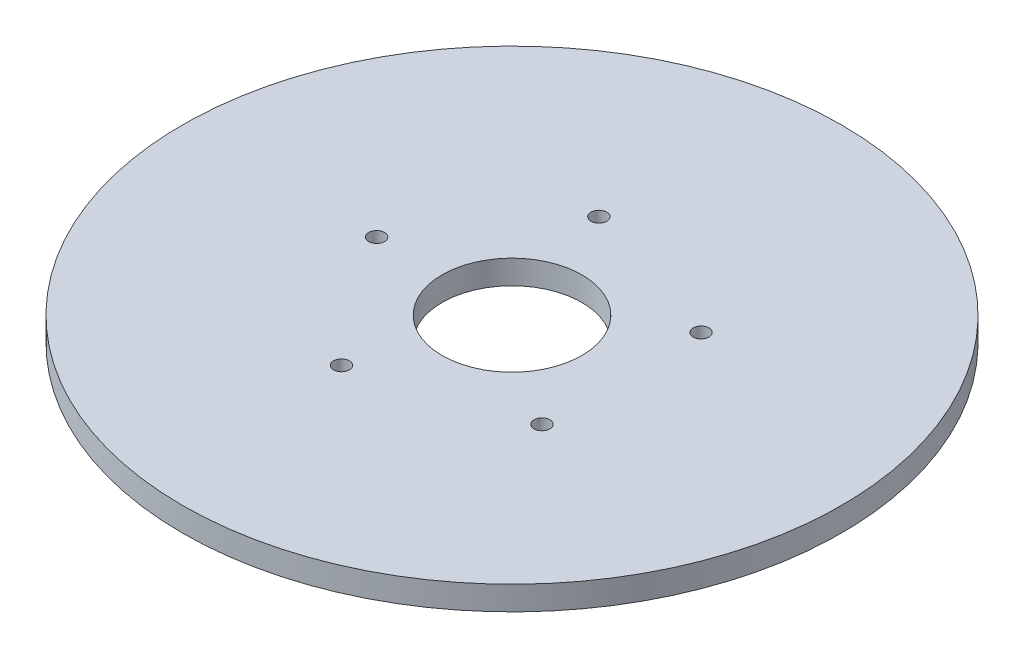
ISO-10303-21;
HEADER;
FILE_DESCRIPTION(('STEP AP214'),'2;1');
FILE_NAME('part.step','',(''),(''),'','','');
FILE_SCHEMA(('AUTOMOTIVE_DESIGN { 1 0 10303 214 1 1 1 1 }'));
ENDSEC;
DATA;
#1=APPLICATION_CONTEXT('core data for automotive mechanical design processes');
#2=APPLICATION_PROTOCOL_DEFINITION('international standard','automotive_design',2000,#1);
#3=PRODUCT_CONTEXT('',#1,'mechanical');
#4=PRODUCT('Part','Part','',(#3));
#5=PRODUCT_RELATED_PRODUCT_CATEGORY('part','',(#4));
#6=PRODUCT_DEFINITION_FORMATION('','',#4);
#7=PRODUCT_DEFINITION_CONTEXT('part definition',#1,'design');
#8=PRODUCT_DEFINITION('design','',#6,#7);
#9=PRODUCT_DEFINITION_SHAPE('','',#8);
#10=(LENGTH_UNIT() NAMED_UNIT(*) SI_UNIT(.MILLI.,.METRE.));
#11=(NAMED_UNIT(*) PLANE_ANGLE_UNIT() SI_UNIT($,.RADIAN.));
#12=(NAMED_UNIT(*) SI_UNIT($,.STERADIAN.) SOLID_ANGLE_UNIT());
#13=UNCERTAINTY_MEASURE_WITH_UNIT(LENGTH_MEASURE(1.E-05),#10,'distance_accuracy_value','');
#14=(GEOMETRIC_REPRESENTATION_CONTEXT(3) GLOBAL_UNCERTAINTY_ASSIGNED_CONTEXT((#13)) GLOBAL_UNIT_ASSIGNED_CONTEXT((#10,
#11,#12)) REPRESENTATION_CONTEXT('',''));
#15=CARTESIAN_POINT('',(0.,0.,0.));
#16=DIRECTION('',(0.,0.,1.));
#17=DIRECTION('',(1.,0.,0.));
#18=AXIS2_PLACEMENT_3D('',#15,#16,#17);
#19=CARTESIAN_POINT('',(0.,6.,0.));
#20=DIRECTION('',(0.,-1.,0.));
#21=DIRECTION('',(0.,0.,-1.));
#22=AXIS2_PLACEMENT_3D('',#19,#20,#21);
#23=CYLINDRICAL_SURFACE('',#22,82.5);
#24=CARTESIAN_POINT('',(0.,6.,0.));
#25=DIRECTION('',(0.,1.,0.));
#26=DIRECTION('',(0.,0.,1.));
#27=AXIS2_PLACEMENT_3D('',#24,#25,#26);
#28=CIRCLE('',#27,82.5);
#29=CARTESIAN_POINT('',(0.,6.,82.5));
#30=VERTEX_POINT('',#29);
#31=EDGE_CURVE('E10',#30,#30,#28,.T.);
#32=ORIENTED_EDGE('',*,*,#31,.F.);
#33=EDGE_LOOP('',(#32));
#34=FACE_BOUND('',#33,.T.);
#35=CARTESIAN_POINT('',(0.,0.,0.));
#36=DIRECTION('',(0.,1.,0.));
#37=DIRECTION('',(0.,0.,1.));
#38=AXIS2_PLACEMENT_3D('',#35,#36,#37);
#39=CIRCLE('',#38,82.5);
#40=CARTESIAN_POINT('',(0.,0.,82.5));
#41=VERTEX_POINT('',#40);
#42=EDGE_CURVE('E37',#41,#41,#39,.T.);
#43=ORIENTED_EDGE('',*,*,#42,.T.);
#44=EDGE_LOOP('',(#43));
#45=FACE_BOUND('',#44,.T.);
#46=ADVANCED_FACE('F40',(#34,#45),#23,.T.);
#47=CARTESIAN_POINT('',(0.,6.,0.));
#48=DIRECTION('',(0.,1.,0.));
#49=DIRECTION('',(0.,0.,1.));
#50=AXIS2_PLACEMENT_3D('',#47,#48,#49);
#51=PLANE('',#50);
#52=CARTESIAN_POINT('',(-10.4708659952054,6.,32.2260118934121));
#53=DIRECTION('',(0.,1.,0.));
#54=DIRECTION('',(0.951056516295155,0.,0.309016994374945));
#55=AXIS2_PLACEMENT_3D('',#52,#53,#54);
#56=CIRCLE('',#55,1.98026602607169);
#57=CARTESIAN_POINT('',(-10.4708659952054,6.,34.2062779194838));
#58=VERTEX_POINT('',#57);
#59=EDGE_CURVE('E78',#58,#58,#56,.T.);
#60=ORIENTED_EDGE('',*,*,#59,.F.);
#61=EDGE_LOOP('',(#60));
#62=FACE_BOUND('',#61,.T.);
#63=CARTESIAN_POINT('',(27.4130830670936,6.,19.9167706719869));
#64=DIRECTION('',(0.,1.,0.));
#65=DIRECTION('',(0.587785252292469,0.,-0.809016994374951));
#66=AXIS2_PLACEMENT_3D('',#63,#64,#65);
#67=CIRCLE('',#66,1.98026602607169);
#68=CARTESIAN_POINT('',(27.4130830670936,6.,21.8970366980586));
#69=VERTEX_POINT('',#68);
#70=EDGE_CURVE('E71',#69,#69,#67,.T.);
#71=ORIENTED_EDGE('',*,*,#70,.F.);
#72=EDGE_LOOP('',(#71));
#73=FACE_BOUND('',#72,.T.);
#74=CARTESIAN_POINT('',(27.4130830670933,6.,-19.9167706719873));
#75=DIRECTION('',(0.,1.,0.));
#76=DIRECTION('',(-0.58778525229248,0.,-0.809016994374942));
#77=AXIS2_PLACEMENT_3D('',#74,#75,#76);
#78=CIRCLE('',#77,1.98026602607169);
#79=CARTESIAN_POINT('',(27.4130830670933,6.,-17.9365046459156));
#80=VERTEX_POINT('',#79);
#81=EDGE_CURVE('E70',#80,#80,#78,.T.);
#82=ORIENTED_EDGE('',*,*,#81,.F.);
#83=EDGE_LOOP('',(#82));
#84=FACE_BOUND('',#83,.T.);
#85=CARTESIAN_POINT('',(-10.4708659952059,6.,-32.226011893412));
#86=DIRECTION('',(0.,1.,0.));
#87=DIRECTION('',(-0.95105651629515,0.,0.309016994374958));
#88=AXIS2_PLACEMENT_3D('',#85,#86,#87);
#89=CIRCLE('',#88,1.98026602607169);
#90=CARTESIAN_POINT('',(-10.4708659952059,6.,-30.2457458673403));
#91=VERTEX_POINT('',#90);
#92=EDGE_CURVE('E61',#91,#91,#89,.T.);
#93=ORIENTED_EDGE('',*,*,#92,.F.);
#94=EDGE_LOOP('',(#93));
#95=FACE_BOUND('',#94,.T.);
#96=CARTESIAN_POINT('',(-33.8844341437759,6.,0.));
#97=DIRECTION('',(0.,1.,0.));
#98=DIRECTION('',(0.,0.,1.));
#99=AXIS2_PLACEMENT_3D('',#96,#97,#98);
#100=CIRCLE('',#99,1.98026602607169);
#101=CARTESIAN_POINT('',(-33.8844341437759,6.,1.98026602607169));
#102=VERTEX_POINT('',#101);
#103=EDGE_CURVE('E54',#102,#102,#100,.T.);
#104=ORIENTED_EDGE('',*,*,#103,.F.);
#105=EDGE_LOOP('',(#104));
#106=FACE_BOUND('',#105,.T.);
#107=CARTESIAN_POINT('',(0.,6.,0.));
#108=DIRECTION('',(0.,1.,0.));
#109=DIRECTION('',(0.,0.,1.));
#110=AXIS2_PLACEMENT_3D('',#107,#108,#109);
#111=CIRCLE('',#110,17.5);
#112=CARTESIAN_POINT('',(0.,6.,17.5));
#113=VERTEX_POINT('',#112);
#114=EDGE_CURVE('E50',#113,#113,#111,.T.);
#115=ORIENTED_EDGE('',*,*,#114,.F.);
#116=EDGE_LOOP('',(#115));
#117=FACE_BOUND('',#116,.T.);
#118=ORIENTED_EDGE('',*,*,#31,.T.);
#119=EDGE_LOOP('',(#118));
#120=FACE_BOUND('',#119,.T.);
#121=ADVANCED_FACE('F94',(#62,#73,#84,#95,#106,#117,#120),#51,.T.);
#122=CARTESIAN_POINT('',(0.,0.,0.));
#123=DIRECTION('',(0.,1.,0.));
#124=DIRECTION('',(0.,0.,1.));
#125=AXIS2_PLACEMENT_3D('',#122,#123,#124);
#126=PLANE('',#125);
#127=CARTESIAN_POINT('',(0.,0.,0.));
#128=DIRECTION('',(0.,1.,0.));
#129=DIRECTION('',(0.,0.,1.));
#130=AXIS2_PLACEMENT_3D('',#127,#128,#129);
#131=CIRCLE('',#130,17.5);
#132=CARTESIAN_POINT('',(0.,0.,17.5));
#133=VERTEX_POINT('',#132);
#134=EDGE_CURVE('E47',#133,#133,#131,.T.);
#135=ORIENTED_EDGE('',*,*,#134,.T.);
#136=EDGE_LOOP('',(#135));
#137=FACE_BOUND('',#136,.T.);
#138=ORIENTED_EDGE('',*,*,#42,.F.);
#139=EDGE_LOOP('',(#138));
#140=FACE_BOUND('',#139,.T.);
#141=ADVANCED_FACE('F100',(#137,#140),#126,.F.);
#142=CARTESIAN_POINT('',(0.,6.,0.));
#143=DIRECTION('',(0.,-1.,0.));
#144=DIRECTION('',(0.,0.,-1.));
#145=AXIS2_PLACEMENT_3D('',#142,#143,#144);
#146=CYLINDRICAL_SURFACE('',#145,17.5);
#147=ORIENTED_EDGE('',*,*,#114,.T.);
#148=EDGE_LOOP('',(#147));
#149=FACE_BOUND('',#148,.T.);
#150=ORIENTED_EDGE('',*,*,#134,.F.);
#151=EDGE_LOOP('',(#150));
#152=FACE_BOUND('',#151,.T.);
#153=ADVANCED_FACE('F108',(#149,#152),#146,.F.);
#154=CARTESIAN_POINT('',(-33.8844341437759,2.18777489392981,0.));
#155=DIRECTION('',(0.,1.,0.));
#156=DIRECTION('',(0.,0.,1.));
#157=AXIS2_PLACEMENT_3D('',#154,#155,#156);
#158=CYLINDRICAL_SURFACE('',#157,1.98026602607169);
#159=CARTESIAN_POINT('',(-33.8844341437759,2.18777489392981,0.));
#160=DIRECTION('',(0.,1.,0.));
#161=DIRECTION('',(0.,0.,1.));
#162=AXIS2_PLACEMENT_3D('',#159,#160,#161);
#163=CIRCLE('',#162,1.98026602607169);
#164=CARTESIAN_POINT('',(-33.8844341437759,2.18777489392981,1.98026602607169));
#165=VERTEX_POINT('',#164);
#166=EDGE_CURVE('E55',#165,#165,#163,.T.);
#167=CARTESIAN_POINT('',(-33.8844341437759,2.18777489392981,1.98026602607169));
#168=CARTESIAN_POINT('',(-33.8844341437759,2.22748557211804,1.98026602607169));
#169=CARTESIAN_POINT('',(-33.8844341437759,2.26719625030627,1.98026602607169));
#170=CARTESIAN_POINT('',(-33.8844341437759,2.34661760668273,1.98026602607169));
#171=CARTESIAN_POINT('',(-33.8844341437759,2.38632828487096,1.98026602607169));
#172=CARTESIAN_POINT('',(-33.8844341437759,2.46574964124743,1.98026602607169));
#173=CARTESIAN_POINT('',(-33.8844341437759,2.50546031943566,1.98026602607169));
#174=CARTESIAN_POINT('',(-33.8844341437759,2.58488167581212,1.98026602607169));
#175=CARTESIAN_POINT('',(-33.8844341437759,2.62459235400035,1.98026602607169));
#176=CARTESIAN_POINT('',(-33.8844341437759,2.70401371037681,1.98026602607169));
#177=CARTESIAN_POINT('',(-33.8844341437759,2.74372438856504,1.98026602607169));
#178=CARTESIAN_POINT('',(-33.8844341437759,2.82314574494151,1.98026602607169));
#179=CARTESIAN_POINT('',(-33.8844341437759,2.86285642312974,1.98026602607169));
#180=CARTESIAN_POINT('',(-33.8844341437759,2.9422777795062,1.98026602607169));
#181=CARTESIAN_POINT('',(-33.8844341437759,2.98198845769443,1.98026602607169));
#182=CARTESIAN_POINT('',(-33.8844341437759,3.06140981407089,1.98026602607169));
#183=CARTESIAN_POINT('',(-33.8844341437759,3.10112049225912,1.98026602607169));
#184=CARTESIAN_POINT('',(-33.8844341437759,3.18054184863559,1.98026602607169));
#185=CARTESIAN_POINT('',(-33.8844341437759,3.22025252682382,1.98026602607169));
#186=CARTESIAN_POINT('',(-33.8844341437759,3.29967388320028,1.98026602607169));
#187=CARTESIAN_POINT('',(-33.8844341437759,3.33938456138851,1.98026602607169));
#188=CARTESIAN_POINT('',(-33.8844341437759,3.41880591776497,1.98026602607169));
#189=CARTESIAN_POINT('',(-33.8844341437759,3.4585165959532,1.98026602607169));
#190=CARTESIAN_POINT('',(-33.8844341437759,3.53793795232967,1.98026602607169));
#191=CARTESIAN_POINT('',(-33.8844341437759,3.5776486305179,1.98026602607169));
#192=CARTESIAN_POINT('',(-33.8844341437759,3.65706998689436,1.98026602607169));
#193=CARTESIAN_POINT('',(-33.8844341437759,3.69678066508259,1.98026602607169));
#194=CARTESIAN_POINT('',(-33.8844341437759,3.77620202145905,1.98026602607169));
#195=CARTESIAN_POINT('',(-33.8844341437759,3.81591269964729,1.98026602607169));
#196=CARTESIAN_POINT('',(-33.8844341437759,3.89533405602375,1.98026602607169));
#197=CARTESIAN_POINT('',(-33.8844341437759,3.93504473421198,1.98026602607169));
#198=CARTESIAN_POINT('',(-33.8844341437759,4.01446609058844,1.98026602607169));
#199=CARTESIAN_POINT('',(-33.8844341437759,4.05417676877667,1.98026602607169));
#200=CARTESIAN_POINT('',(-33.8844341437759,4.13359812515313,1.98026602607169));
#201=CARTESIAN_POINT('',(-33.8844341437759,4.17330880334137,1.98026602607169));
#202=CARTESIAN_POINT('',(-33.8844341437759,4.25273015971783,1.98026602607169));
#203=CARTESIAN_POINT('',(-33.8844341437759,4.29244083790606,1.98026602607169));
#204=CARTESIAN_POINT('',(-33.8844341437759,4.37186219428252,1.98026602607169));
#205=CARTESIAN_POINT('',(-33.8844341437759,4.41157287247075,1.98026602607169));
#206=CARTESIAN_POINT('',(-33.8844341437759,4.49099422884721,1.98026602607169));
#207=CARTESIAN_POINT('',(-33.8844341437759,4.53070490703545,1.98026602607169));
#208=CARTESIAN_POINT('',(-33.8844341437759,4.61012626341191,1.98026602607169));
#209=CARTESIAN_POINT('',(-33.8844341437759,4.64983694160014,1.98026602607169));
#210=CARTESIAN_POINT('',(-33.8844341437759,4.7292582979766,1.98026602607169));
#211=CARTESIAN_POINT('',(-33.8844341437759,4.76896897616483,1.98026602607169));
#212=CARTESIAN_POINT('',(-33.8844341437759,4.8483903325413,1.98026602607169));
#213=CARTESIAN_POINT('',(-33.8844341437759,4.88810101072953,1.98026602607169));
#214=CARTESIAN_POINT('',(-33.8844341437759,4.96752236710599,1.98026602607169));
#215=CARTESIAN_POINT('',(-33.8844341437759,5.00723304529422,1.98026602607169));
#216=CARTESIAN_POINT('',(-33.8844341437759,5.08665440167068,1.98026602607169));
#217=CARTESIAN_POINT('',(-33.8844341437759,5.12636507985891,1.98026602607169));
#218=CARTESIAN_POINT('',(-33.8844341437759,5.20578643623538,1.98026602607169));
#219=CARTESIAN_POINT('',(-33.8844341437759,5.24549711442361,1.98026602607169));
#220=CARTESIAN_POINT('',(-33.8844341437759,5.32491847080007,1.98026602607169));
#221=CARTESIAN_POINT('',(-33.8844341437759,5.3646291489883,1.98026602607169));
#222=CARTESIAN_POINT('',(-33.8844341437759,5.44405050536476,1.98026602607169));
#223=CARTESIAN_POINT('',(-33.8844341437759,5.48376118355299,1.98026602607169));
#224=CARTESIAN_POINT('',(-33.8844341437759,5.56318253992946,1.98026602607169));
#225=CARTESIAN_POINT('',(-33.8844341437759,5.60289321811769,1.98026602607169));
#226=CARTESIAN_POINT('',(-33.8844341437759,5.68231457449415,1.98026602607169));
#227=CARTESIAN_POINT('',(-33.8844341437759,5.72202525268238,1.98026602607169));
#228=CARTESIAN_POINT('',(-33.8844341437759,5.80144660905884,1.98026602607169));
#229=CARTESIAN_POINT('',(-33.8844341437759,5.84115728724707,1.98026602607169));
#230=CARTESIAN_POINT('',(-33.8844341437759,5.92057864362354,1.98026602607169));
#231=CARTESIAN_POINT('',(-33.8844341437759,5.96028932181177,1.98026602607169));
#232=CARTESIAN_POINT('',(-33.8844341437759,6.,1.98026602607169));
#233=B_SPLINE_CURVE_WITH_KNOTS('',3,(#167,#168,#169,#170,#171,#172,#173,#174,#175,#176,#177,
#178,#179,#180,#181,#182,#183,#184,#185,#186,#187,#188,#189,#190,#191,#192,#193,#194,#195,#196,
#197,#198,#199,#200,#201,#202,#203,#204,#205,#206,#207,#208,#209,#210,#211,#212,#213,#214,#215,
#216,#217,#218,#219,#220,#221,#222,#223,#224,#225,#226,#227,#228,#229,#230,#231,#232),
.UNSPECIFIED.,.F.,.F.,(4,2,2,2,2,2,2,2,2,2,2,2,2,2,2,2,2,2,2,2,2,2,2,2,2,2,2,2,2,2,2,2,4),(0.,
0.119132034564694,0.238264069129387,0.35739610369408,0.476528138258774,0.595660172823468,
0.714792207388161,0.833924241952855,0.953056276517548,1.07218831108224,1.19132034564694,
1.31045238021163,1.42958441477632,1.54871644934102,1.66784848390571,1.7869805184704,
1.9061125530351,2.02524458759979,2.14437662216448,2.26350865672918,2.38264069129387,
2.50177272585856,2.62090476042326,2.74003679498795,2.85916882955264,2.97830086411734,
3.09743289868203,3.21656493324672,3.33569696781142,3.45482900237611,3.57396103694081,
3.6930930715055,3.81222510607019),.UNSPECIFIED.);
#234=EDGE_CURVE('BSEAM115',#165,#102,#233,.T.);
#235=ORIENTED_EDGE('',*,*,#166,.F.);
#236=ORIENTED_EDGE('',*,*,#103,.T.);
#237=ORIENTED_EDGE('',*,*,#234,.T.);
#238=ORIENTED_EDGE('',*,*,#234,.F.);
#239=EDGE_LOOP('',(#235,#237,#236,#238));
#240=FACE_BOUND('',#239,.T.);
#241=ADVANCED_FACE('F115',(#240),#158,.F.);
#242=CARTESIAN_POINT('',(-33.8844341437759,2.18777489392981,0.));
#243=DIRECTION('',(0.,1.,0.));
#244=DIRECTION('',(0.,0.,1.));
#245=AXIS2_PLACEMENT_3D('',#242,#243,#244);
#246=PLANE('',#245);
#247=ORIENTED_EDGE('',*,*,#166,.T.);
#248=EDGE_LOOP('',(#247));
#249=FACE_BOUND('',#248,.T.);
#250=ADVANCED_FACE('F142',(#249),#246,.T.);
#251=CARTESIAN_POINT('',(-10.4708659952059,2.18777489392981,-32.226011893412));
#252=DIRECTION('',(0.,1.,0.));
#253=DIRECTION('',(0.,0.,1.));
#254=AXIS2_PLACEMENT_3D('',#251,#252,#253);
#255=CYLINDRICAL_SURFACE('',#254,1.98026602607169);
#256=CARTESIAN_POINT('',(-10.4708659952059,2.18777489392981,-32.226011893412));
#257=DIRECTION('',(0.,1.,0.));
#258=DIRECTION('',(-0.95105651629515,0.,0.309016994374958));
#259=AXIS2_PLACEMENT_3D('',#256,#257,#258);
#260=CIRCLE('',#259,1.98026602607169);
#261=CARTESIAN_POINT('',(-10.4708659952059,2.18777489392981,-30.2457458673403));
#262=VERTEX_POINT('',#261);
#263=EDGE_CURVE('E63',#262,#262,#260,.T.);
#264=CARTESIAN_POINT('',(-10.4708659952059,2.18777489392981,-30.2457458673403));
#265=CARTESIAN_POINT('',(-10.4708659952059,2.22748557211804,-30.2457458673403));
#266=CARTESIAN_POINT('',(-10.4708659952059,2.26719625030627,-30.2457458673403));
#267=CARTESIAN_POINT('',(-10.4708659952059,2.34661760668273,-30.2457458673403));
#268=CARTESIAN_POINT('',(-10.4708659952059,2.38632828487096,-30.2457458673403));
#269=CARTESIAN_POINT('',(-10.4708659952059,2.46574964124743,-30.2457458673403));
#270=CARTESIAN_POINT('',(-10.4708659952059,2.50546031943566,-30.2457458673403));
#271=CARTESIAN_POINT('',(-10.4708659952059,2.58488167581212,-30.2457458673403));
#272=CARTESIAN_POINT('',(-10.4708659952059,2.62459235400035,-30.2457458673403));
#273=CARTESIAN_POINT('',(-10.4708659952059,2.70401371037681,-30.2457458673403));
#274=CARTESIAN_POINT('',(-10.4708659952059,2.74372438856504,-30.2457458673403));
#275=CARTESIAN_POINT('',(-10.4708659952059,2.82314574494151,-30.2457458673403));
#276=CARTESIAN_POINT('',(-10.4708659952059,2.86285642312974,-30.2457458673403));
#277=CARTESIAN_POINT('',(-10.4708659952059,2.9422777795062,-30.2457458673403));
#278=CARTESIAN_POINT('',(-10.4708659952059,2.98198845769443,-30.2457458673403));
#279=CARTESIAN_POINT('',(-10.4708659952059,3.06140981407089,-30.2457458673403));
#280=CARTESIAN_POINT('',(-10.4708659952059,3.10112049225912,-30.2457458673403));
#281=CARTESIAN_POINT('',(-10.4708659952059,3.18054184863559,-30.2457458673403));
#282=CARTESIAN_POINT('',(-10.4708659952059,3.22025252682382,-30.2457458673403));
#283=CARTESIAN_POINT('',(-10.4708659952059,3.29967388320028,-30.2457458673403));
#284=CARTESIAN_POINT('',(-10.4708659952059,3.33938456138851,-30.2457458673403));
#285=CARTESIAN_POINT('',(-10.4708659952059,3.41880591776497,-30.2457458673403));
#286=CARTESIAN_POINT('',(-10.4708659952059,3.4585165959532,-30.2457458673403));
#287=CARTESIAN_POINT('',(-10.4708659952059,3.53793795232967,-30.2457458673403));
#288=CARTESIAN_POINT('',(-10.4708659952059,3.5776486305179,-30.2457458673403));
#289=CARTESIAN_POINT('',(-10.4708659952059,3.65706998689436,-30.2457458673403));
#290=CARTESIAN_POINT('',(-10.4708659952059,3.69678066508259,-30.2457458673403));
#291=CARTESIAN_POINT('',(-10.4708659952059,3.77620202145905,-30.2457458673403));
#292=CARTESIAN_POINT('',(-10.4708659952059,3.81591269964729,-30.2457458673403));
#293=CARTESIAN_POINT('',(-10.4708659952059,3.89533405602375,-30.2457458673403));
#294=CARTESIAN_POINT('',(-10.4708659952059,3.93504473421198,-30.2457458673403));
#295=CARTESIAN_POINT('',(-10.4708659952059,4.01446609058844,-30.2457458673403));
#296=CARTESIAN_POINT('',(-10.4708659952059,4.05417676877667,-30.2457458673403));
#297=CARTESIAN_POINT('',(-10.4708659952059,4.13359812515313,-30.2457458673403));
#298=CARTESIAN_POINT('',(-10.4708659952059,4.17330880334137,-30.2457458673403));
#299=CARTESIAN_POINT('',(-10.4708659952059,4.25273015971783,-30.2457458673403));
#300=CARTESIAN_POINT('',(-10.4708659952059,4.29244083790606,-30.2457458673403));
#301=CARTESIAN_POINT('',(-10.4708659952059,4.37186219428252,-30.2457458673403));
#302=CARTESIAN_POINT('',(-10.4708659952059,4.41157287247075,-30.2457458673403));
#303=CARTESIAN_POINT('',(-10.4708659952059,4.49099422884721,-30.2457458673403));
#304=CARTESIAN_POINT('',(-10.4708659952059,4.53070490703545,-30.2457458673403));
#305=CARTESIAN_POINT('',(-10.4708659952059,4.61012626341191,-30.2457458673403));
#306=CARTESIAN_POINT('',(-10.4708659952059,4.64983694160014,-30.2457458673403));
#307=CARTESIAN_POINT('',(-10.4708659952059,4.7292582979766,-30.2457458673403));
#308=CARTESIAN_POINT('',(-10.4708659952059,4.76896897616483,-30.2457458673403));
#309=CARTESIAN_POINT('',(-10.4708659952059,4.8483903325413,-30.2457458673403));
#310=CARTESIAN_POINT('',(-10.4708659952059,4.88810101072953,-30.2457458673403));
#311=CARTESIAN_POINT('',(-10.4708659952059,4.96752236710599,-30.2457458673403));
#312=CARTESIAN_POINT('',(-10.4708659952059,5.00723304529422,-30.2457458673403));
#313=CARTESIAN_POINT('',(-10.4708659952059,5.08665440167068,-30.2457458673403));
#314=CARTESIAN_POINT('',(-10.4708659952059,5.12636507985891,-30.2457458673403));
#315=CARTESIAN_POINT('',(-10.4708659952059,5.20578643623538,-30.2457458673403));
#316=CARTESIAN_POINT('',(-10.4708659952059,5.24549711442361,-30.2457458673403));
#317=CARTESIAN_POINT('',(-10.4708659952059,5.32491847080007,-30.2457458673403));
#318=CARTESIAN_POINT('',(-10.4708659952059,5.3646291489883,-30.2457458673403));
#319=CARTESIAN_POINT('',(-10.4708659952059,5.44405050536476,-30.2457458673403));
#320=CARTESIAN_POINT('',(-10.4708659952059,5.48376118355299,-30.2457458673403));
#321=CARTESIAN_POINT('',(-10.4708659952059,5.56318253992946,-30.2457458673403));
#322=CARTESIAN_POINT('',(-10.4708659952059,5.60289321811769,-30.2457458673403));
#323=CARTESIAN_POINT('',(-10.4708659952059,5.68231457449415,-30.2457458673403));
#324=CARTESIAN_POINT('',(-10.4708659952059,5.72202525268238,-30.2457458673403));
#325=CARTESIAN_POINT('',(-10.4708659952059,5.80144660905884,-30.2457458673403));
#326=CARTESIAN_POINT('',(-10.4708659952059,5.84115728724707,-30.2457458673403));
#327=CARTESIAN_POINT('',(-10.4708659952059,5.92057864362354,-30.2457458673403));
#328=CARTESIAN_POINT('',(-10.4708659952059,5.96028932181177,-30.2457458673403));
#329=CARTESIAN_POINT('',(-10.4708659952059,6.,-30.2457458673403));
#330=B_SPLINE_CURVE_WITH_KNOTS('',3,(#264,#265,#266,#267,#268,#269,#270,#271,#272,#273,#274,
#275,#276,#277,#278,#279,#280,#281,#282,#283,#284,#285,#286,#287,#288,#289,#290,#291,#292,#293,
#294,#295,#296,#297,#298,#299,#300,#301,#302,#303,#304,#305,#306,#307,#308,#309,#310,#311,#312,
#313,#314,#315,#316,#317,#318,#319,#320,#321,#322,#323,#324,#325,#326,#327,#328,#329),
.UNSPECIFIED.,.F.,.F.,(4,2,2,2,2,2,2,2,2,2,2,2,2,2,2,2,2,2,2,2,2,2,2,2,2,2,2,2,2,2,2,2,4),(0.,
0.119132034564694,0.238264069129387,0.35739610369408,0.476528138258774,0.595660172823468,
0.714792207388161,0.833924241952855,0.953056276517548,1.07218831108224,1.19132034564694,
1.31045238021163,1.42958441477632,1.54871644934102,1.66784848390571,1.7869805184704,
1.9061125530351,2.02524458759979,2.14437662216448,2.26350865672918,2.38264069129387,
2.50177272585856,2.62090476042326,2.74003679498795,2.85916882955264,2.97830086411734,
3.09743289868203,3.21656493324672,3.33569696781142,3.45482900237611,3.57396103694081,
3.6930930715055,3.81222510607019),.UNSPECIFIED.);
#331=EDGE_CURVE('BSEAM147',#262,#91,#330,.T.);
#332=ORIENTED_EDGE('',*,*,#263,.F.);
#333=ORIENTED_EDGE('',*,*,#92,.T.);
#334=ORIENTED_EDGE('',*,*,#331,.T.);
#335=ORIENTED_EDGE('',*,*,#331,.F.);
#336=EDGE_LOOP('',(#332,#334,#333,#335));
#337=FACE_BOUND('',#336,.T.);
#338=ADVANCED_FACE('F147',(#337),#255,.F.);
#339=CARTESIAN_POINT('',(-10.4708659952059,2.18777489392981,-32.226011893412));
#340=DIRECTION('',(0.,1.,0.));
#341=DIRECTION('',(-0.95105651629515,0.,0.309016994374958));
#342=AXIS2_PLACEMENT_3D('',#339,#340,#341);
#343=PLANE('',#342);
#344=ORIENTED_EDGE('',*,*,#263,.T.);
#345=EDGE_LOOP('',(#344));
#346=FACE_BOUND('',#345,.T.);
#347=ADVANCED_FACE('F163',(#346),#343,.T.);
#348=CARTESIAN_POINT('',(27.4130830670933,2.18777489392981,-19.9167706719873));
#349=DIRECTION('',(0.,1.,0.));
#350=DIRECTION('',(0.,0.,1.));
#351=AXIS2_PLACEMENT_3D('',#348,#349,#350);
#352=CYLINDRICAL_SURFACE('',#351,1.98026602607169);
#353=CARTESIAN_POINT('',(27.4130830670933,2.18777489392981,-19.9167706719873));
#354=DIRECTION('',(0.,1.,0.));
#355=DIRECTION('',(-0.58778525229248,0.,-0.809016994374942));
#356=AXIS2_PLACEMENT_3D('',#353,#354,#355);
#357=CIRCLE('',#356,1.98026602607169);
#358=CARTESIAN_POINT('',(27.4130830670933,2.18777489392981,-17.9365046459156));
#359=VERTEX_POINT('',#358);
#360=EDGE_CURVE('E69',#359,#359,#357,.T.);
#361=CARTESIAN_POINT('',(27.4130830670933,2.18777489392981,-17.9365046459156));
#362=CARTESIAN_POINT('',(27.4130830670933,2.22748557211804,-17.9365046459156));
#363=CARTESIAN_POINT('',(27.4130830670933,2.26719625030627,-17.9365046459156));
#364=CARTESIAN_POINT('',(27.4130830670933,2.34661760668273,-17.9365046459156));
#365=CARTESIAN_POINT('',(27.4130830670933,2.38632828487096,-17.9365046459156));
#366=CARTESIAN_POINT('',(27.4130830670933,2.46574964124743,-17.9365046459156));
#367=CARTESIAN_POINT('',(27.4130830670933,2.50546031943566,-17.9365046459156));
#368=CARTESIAN_POINT('',(27.4130830670933,2.58488167581212,-17.9365046459156));
#369=CARTESIAN_POINT('',(27.4130830670933,2.62459235400035,-17.9365046459156));
#370=CARTESIAN_POINT('',(27.4130830670933,2.70401371037681,-17.9365046459156));
#371=CARTESIAN_POINT('',(27.4130830670933,2.74372438856504,-17.9365046459156));
#372=CARTESIAN_POINT('',(27.4130830670933,2.82314574494151,-17.9365046459156));
#373=CARTESIAN_POINT('',(27.4130830670933,2.86285642312974,-17.9365046459156));
#374=CARTESIAN_POINT('',(27.4130830670933,2.9422777795062,-17.9365046459156));
#375=CARTESIAN_POINT('',(27.4130830670933,2.98198845769443,-17.9365046459156));
#376=CARTESIAN_POINT('',(27.4130830670933,3.06140981407089,-17.9365046459156));
#377=CARTESIAN_POINT('',(27.4130830670933,3.10112049225912,-17.9365046459156));
#378=CARTESIAN_POINT('',(27.4130830670933,3.18054184863559,-17.9365046459156));
#379=CARTESIAN_POINT('',(27.4130830670933,3.22025252682382,-17.9365046459156));
#380=CARTESIAN_POINT('',(27.4130830670933,3.29967388320028,-17.9365046459156));
#381=CARTESIAN_POINT('',(27.4130830670933,3.33938456138851,-17.9365046459156));
#382=CARTESIAN_POINT('',(27.4130830670933,3.41880591776497,-17.9365046459156));
#383=CARTESIAN_POINT('',(27.4130830670933,3.4585165959532,-17.9365046459156));
#384=CARTESIAN_POINT('',(27.4130830670933,3.53793795232967,-17.9365046459156));
#385=CARTESIAN_POINT('',(27.4130830670933,3.5776486305179,-17.9365046459156));
#386=CARTESIAN_POINT('',(27.4130830670933,3.65706998689436,-17.9365046459156));
#387=CARTESIAN_POINT('',(27.4130830670933,3.69678066508259,-17.9365046459156));
#388=CARTESIAN_POINT('',(27.4130830670933,3.77620202145905,-17.9365046459156));
#389=CARTESIAN_POINT('',(27.4130830670933,3.81591269964729,-17.9365046459156));
#390=CARTESIAN_POINT('',(27.4130830670933,3.89533405602375,-17.9365046459156));
#391=CARTESIAN_POINT('',(27.4130830670933,3.93504473421198,-17.9365046459156));
#392=CARTESIAN_POINT('',(27.4130830670933,4.01446609058844,-17.9365046459156));
#393=CARTESIAN_POINT('',(27.4130830670933,4.05417676877667,-17.9365046459156));
#394=CARTESIAN_POINT('',(27.4130830670933,4.13359812515313,-17.9365046459156));
#395=CARTESIAN_POINT('',(27.4130830670933,4.17330880334137,-17.9365046459156));
#396=CARTESIAN_POINT('',(27.4130830670933,4.25273015971783,-17.9365046459156));
#397=CARTESIAN_POINT('',(27.4130830670933,4.29244083790606,-17.9365046459156));
#398=CARTESIAN_POINT('',(27.4130830670933,4.37186219428252,-17.9365046459156));
#399=CARTESIAN_POINT('',(27.4130830670933,4.41157287247075,-17.9365046459156));
#400=CARTESIAN_POINT('',(27.4130830670933,4.49099422884721,-17.9365046459156));
#401=CARTESIAN_POINT('',(27.4130830670933,4.53070490703545,-17.9365046459156));
#402=CARTESIAN_POINT('',(27.4130830670933,4.61012626341191,-17.9365046459156));
#403=CARTESIAN_POINT('',(27.4130830670933,4.64983694160014,-17.9365046459156));
#404=CARTESIAN_POINT('',(27.4130830670933,4.7292582979766,-17.9365046459156));
#405=CARTESIAN_POINT('',(27.4130830670933,4.76896897616483,-17.9365046459156));
#406=CARTESIAN_POINT('',(27.4130830670933,4.8483903325413,-17.9365046459156));
#407=CARTESIAN_POINT('',(27.4130830670933,4.88810101072953,-17.9365046459156));
#408=CARTESIAN_POINT('',(27.4130830670933,4.96752236710599,-17.9365046459156));
#409=CARTESIAN_POINT('',(27.4130830670933,5.00723304529422,-17.9365046459156));
#410=CARTESIAN_POINT('',(27.4130830670933,5.08665440167068,-17.9365046459156));
#411=CARTESIAN_POINT('',(27.4130830670933,5.12636507985891,-17.9365046459156));
#412=CARTESIAN_POINT('',(27.4130830670933,5.20578643623538,-17.9365046459156));
#413=CARTESIAN_POINT('',(27.4130830670933,5.24549711442361,-17.9365046459156));
#414=CARTESIAN_POINT('',(27.4130830670933,5.32491847080007,-17.9365046459156));
#415=CARTESIAN_POINT('',(27.4130830670933,5.3646291489883,-17.9365046459156));
#416=CARTESIAN_POINT('',(27.4130830670933,5.44405050536476,-17.9365046459156));
#417=CARTESIAN_POINT('',(27.4130830670933,5.48376118355299,-17.9365046459156));
#418=CARTESIAN_POINT('',(27.4130830670933,5.56318253992946,-17.9365046459156));
#419=CARTESIAN_POINT('',(27.4130830670933,5.60289321811769,-17.9365046459156));
#420=CARTESIAN_POINT('',(27.4130830670933,5.68231457449415,-17.9365046459156));
#421=CARTESIAN_POINT('',(27.4130830670933,5.72202525268238,-17.9365046459156));
#422=CARTESIAN_POINT('',(27.4130830670933,5.80144660905884,-17.9365046459156));
#423=CARTESIAN_POINT('',(27.4130830670933,5.84115728724707,-17.9365046459156));
#424=CARTESIAN_POINT('',(27.4130830670933,5.92057864362354,-17.9365046459156));
#425=CARTESIAN_POINT('',(27.4130830670933,5.96028932181177,-17.9365046459156));
#426=CARTESIAN_POINT('',(27.4130830670933,6.,-17.9365046459156));
#427=B_SPLINE_CURVE_WITH_KNOTS('',3,(#361,#362,#363,#364,#365,#366,#367,#368,#369,#370,#371,
#372,#373,#374,#375,#376,#377,#378,#379,#380,#381,#382,#383,#384,#385,#386,#387,#388,#389,#390,
#391,#392,#393,#394,#395,#396,#397,#398,#399,#400,#401,#402,#403,#404,#405,#406,#407,#408,#409,
#410,#411,#412,#413,#414,#415,#416,#417,#418,#419,#420,#421,#422,#423,#424,#425,#426),
.UNSPECIFIED.,.F.,.F.,(4,2,2,2,2,2,2,2,2,2,2,2,2,2,2,2,2,2,2,2,2,2,2,2,2,2,2,2,2,2,2,2,4),(0.,
0.119132034564694,0.238264069129387,0.35739610369408,0.476528138258774,0.595660172823468,
0.714792207388161,0.833924241952855,0.953056276517548,1.07218831108224,1.19132034564694,
1.31045238021163,1.42958441477632,1.54871644934102,1.66784848390571,1.7869805184704,
1.9061125530351,2.02524458759979,2.14437662216448,2.26350865672918,2.38264069129387,
2.50177272585856,2.62090476042326,2.74003679498795,2.85916882955264,2.97830086411734,
3.09743289868203,3.21656493324672,3.33569696781142,3.45482900237611,3.57396103694081,
3.6930930715055,3.81222510607019),.UNSPECIFIED.);
#428=EDGE_CURVE('BSEAM172',#359,#80,#427,.T.);
#429=ORIENTED_EDGE('',*,*,#360,.F.);
#430=ORIENTED_EDGE('',*,*,#81,.T.);
#431=ORIENTED_EDGE('',*,*,#428,.T.);
#432=ORIENTED_EDGE('',*,*,#428,.F.);
#433=EDGE_LOOP('',(#429,#431,#430,#432));
#434=FACE_BOUND('',#433,.T.);
#435=ADVANCED_FACE('F172',(#434),#352,.F.);
#436=CARTESIAN_POINT('',(27.4130830670933,2.18777489392981,-19.9167706719873));
#437=DIRECTION('',(0.,1.,0.));
#438=DIRECTION('',(-0.58778525229248,0.,-0.809016994374942));
#439=AXIS2_PLACEMENT_3D('',#436,#437,#438);
#440=PLANE('',#439);
#441=ORIENTED_EDGE('',*,*,#360,.T.);
#442=EDGE_LOOP('',(#441));
#443=FACE_BOUND('',#442,.T.);
#444=ADVANCED_FACE('F185',(#443),#440,.T.);
#445=CARTESIAN_POINT('',(27.4130830670936,2.18777489392981,19.9167706719869));
#446=DIRECTION('',(0.,1.,0.));
#447=DIRECTION('',(0.,0.,1.));
#448=AXIS2_PLACEMENT_3D('',#445,#446,#447);
#449=CYLINDRICAL_SURFACE('',#448,1.98026602607169);
#450=CARTESIAN_POINT('',(27.4130830670936,2.18777489392981,19.9167706719869));
#451=DIRECTION('',(0.,1.,0.));
#452=DIRECTION('',(0.587785252292469,0.,-0.809016994374951));
#453=AXIS2_PLACEMENT_3D('',#450,#451,#452);
#454=CIRCLE('',#453,1.98026602607169);
#455=CARTESIAN_POINT('',(27.4130830670936,2.18777489392981,21.8970366980586));
#456=VERTEX_POINT('',#455);
#457=EDGE_CURVE('E76',#456,#456,#454,.T.);
#458=CARTESIAN_POINT('',(27.4130830670936,2.18777489392981,21.8970366980586));
#459=CARTESIAN_POINT('',(27.4130830670936,2.22748557211804,21.8970366980586));
#460=CARTESIAN_POINT('',(27.4130830670936,2.26719625030627,21.8970366980586));
#461=CARTESIAN_POINT('',(27.4130830670936,2.34661760668273,21.8970366980586));
#462=CARTESIAN_POINT('',(27.4130830670936,2.38632828487096,21.8970366980586));
#463=CARTESIAN_POINT('',(27.4130830670936,2.46574964124743,21.8970366980586));
#464=CARTESIAN_POINT('',(27.4130830670936,2.50546031943566,21.8970366980586));
#465=CARTESIAN_POINT('',(27.4130830670936,2.58488167581212,21.8970366980586));
#466=CARTESIAN_POINT('',(27.4130830670936,2.62459235400035,21.8970366980586));
#467=CARTESIAN_POINT('',(27.4130830670936,2.70401371037681,21.8970366980586));
#468=CARTESIAN_POINT('',(27.4130830670936,2.74372438856504,21.8970366980586));
#469=CARTESIAN_POINT('',(27.4130830670936,2.82314574494151,21.8970366980586));
#470=CARTESIAN_POINT('',(27.4130830670936,2.86285642312974,21.8970366980586));
#471=CARTESIAN_POINT('',(27.4130830670936,2.9422777795062,21.8970366980586));
#472=CARTESIAN_POINT('',(27.4130830670936,2.98198845769443,21.8970366980586));
#473=CARTESIAN_POINT('',(27.4130830670936,3.06140981407089,21.8970366980586));
#474=CARTESIAN_POINT('',(27.4130830670936,3.10112049225912,21.8970366980586));
#475=CARTESIAN_POINT('',(27.4130830670936,3.18054184863559,21.8970366980586));
#476=CARTESIAN_POINT('',(27.4130830670936,3.22025252682382,21.8970366980586));
#477=CARTESIAN_POINT('',(27.4130830670936,3.29967388320028,21.8970366980586));
#478=CARTESIAN_POINT('',(27.4130830670936,3.33938456138851,21.8970366980586));
#479=CARTESIAN_POINT('',(27.4130830670936,3.41880591776497,21.8970366980586));
#480=CARTESIAN_POINT('',(27.4130830670936,3.4585165959532,21.8970366980586));
#481=CARTESIAN_POINT('',(27.4130830670936,3.53793795232967,21.8970366980586));
#482=CARTESIAN_POINT('',(27.4130830670936,3.5776486305179,21.8970366980586));
#483=CARTESIAN_POINT('',(27.4130830670936,3.65706998689436,21.8970366980586));
#484=CARTESIAN_POINT('',(27.4130830670936,3.69678066508259,21.8970366980586));
#485=CARTESIAN_POINT('',(27.4130830670936,3.77620202145905,21.8970366980586));
#486=CARTESIAN_POINT('',(27.4130830670936,3.81591269964729,21.8970366980586));
#487=CARTESIAN_POINT('',(27.4130830670936,3.89533405602375,21.8970366980586));
#488=CARTESIAN_POINT('',(27.4130830670936,3.93504473421198,21.8970366980586));
#489=CARTESIAN_POINT('',(27.4130830670936,4.01446609058844,21.8970366980586));
#490=CARTESIAN_POINT('',(27.4130830670936,4.05417676877667,21.8970366980586));
#491=CARTESIAN_POINT('',(27.4130830670936,4.13359812515313,21.8970366980586));
#492=CARTESIAN_POINT('',(27.4130830670936,4.17330880334137,21.8970366980586));
#493=CARTESIAN_POINT('',(27.4130830670936,4.25273015971783,21.8970366980586));
#494=CARTESIAN_POINT('',(27.4130830670936,4.29244083790606,21.8970366980586));
#495=CARTESIAN_POINT('',(27.4130830670936,4.37186219428252,21.8970366980586));
#496=CARTESIAN_POINT('',(27.4130830670936,4.41157287247075,21.8970366980586));
#497=CARTESIAN_POINT('',(27.4130830670936,4.49099422884721,21.8970366980586));
#498=CARTESIAN_POINT('',(27.4130830670936,4.53070490703545,21.8970366980586));
#499=CARTESIAN_POINT('',(27.4130830670936,4.61012626341191,21.8970366980586));
#500=CARTESIAN_POINT('',(27.4130830670936,4.64983694160014,21.8970366980586));
#501=CARTESIAN_POINT('',(27.4130830670936,4.7292582979766,21.8970366980586));
#502=CARTESIAN_POINT('',(27.4130830670936,4.76896897616483,21.8970366980586));
#503=CARTESIAN_POINT('',(27.4130830670936,4.8483903325413,21.8970366980586));
#504=CARTESIAN_POINT('',(27.4130830670936,4.88810101072953,21.8970366980586));
#505=CARTESIAN_POINT('',(27.4130830670936,4.96752236710599,21.8970366980586));
#506=CARTESIAN_POINT('',(27.4130830670936,5.00723304529422,21.8970366980586));
#507=CARTESIAN_POINT('',(27.4130830670936,5.08665440167068,21.8970366980586));
#508=CARTESIAN_POINT('',(27.4130830670936,5.12636507985891,21.8970366980586));
#509=CARTESIAN_POINT('',(27.4130830670936,5.20578643623538,21.8970366980586));
#510=CARTESIAN_POINT('',(27.4130830670936,5.24549711442361,21.8970366980586));
#511=CARTESIAN_POINT('',(27.4130830670936,5.32491847080007,21.8970366980586));
#512=CARTESIAN_POINT('',(27.4130830670936,5.3646291489883,21.8970366980586));
#513=CARTESIAN_POINT('',(27.4130830670936,5.44405050536476,21.8970366980586));
#514=CARTESIAN_POINT('',(27.4130830670936,5.48376118355299,21.8970366980586));
#515=CARTESIAN_POINT('',(27.4130830670936,5.56318253992946,21.8970366980586));
#516=CARTESIAN_POINT('',(27.4130830670936,5.60289321811769,21.8970366980586));
#517=CARTESIAN_POINT('',(27.4130830670936,5.68231457449415,21.8970366980586));
#518=CARTESIAN_POINT('',(27.4130830670936,5.72202525268238,21.8970366980586));
#519=CARTESIAN_POINT('',(27.4130830670936,5.80144660905884,21.8970366980586));
#520=CARTESIAN_POINT('',(27.4130830670936,5.84115728724707,21.8970366980586));
#521=CARTESIAN_POINT('',(27.4130830670936,5.92057864362354,21.8970366980586));
#522=CARTESIAN_POINT('',(27.4130830670936,5.96028932181177,21.8970366980586));
#523=CARTESIAN_POINT('',(27.4130830670936,6.,21.8970366980586));
#524=B_SPLINE_CURVE_WITH_KNOTS('',3,(#458,#459,#460,#461,#462,#463,#464,#465,#466,#467,#468,
#469,#470,#471,#472,#473,#474,#475,#476,#477,#478,#479,#480,#481,#482,#483,#484,#485,#486,#487,
#488,#489,#490,#491,#492,#493,#494,#495,#496,#497,#498,#499,#500,#501,#502,#503,#504,#505,#506,
#507,#508,#509,#510,#511,#512,#513,#514,#515,#516,#517,#518,#519,#520,#521,#522,#523),
.UNSPECIFIED.,.F.,.F.,(4,2,2,2,2,2,2,2,2,2,2,2,2,2,2,2,2,2,2,2,2,2,2,2,2,2,2,2,2,2,2,2,4),(0.,
0.119132034564694,0.238264069129387,0.35739610369408,0.476528138258774,0.595660172823468,
0.714792207388161,0.833924241952855,0.953056276517548,1.07218831108224,1.19132034564694,
1.31045238021163,1.42958441477632,1.54871644934102,1.66784848390571,1.7869805184704,
1.9061125530351,2.02524458759979,2.14437662216448,2.26350865672918,2.38264069129387,
2.50177272585856,2.62090476042326,2.74003679498795,2.85916882955264,2.97830086411734,
3.09743289868203,3.21656493324672,3.33569696781142,3.45482900237611,3.57396103694081,
3.6930930715055,3.81222510607019),.UNSPECIFIED.);
#525=EDGE_CURVE('BSEAM191',#456,#69,#524,.T.);
#526=ORIENTED_EDGE('',*,*,#457,.F.);
#527=ORIENTED_EDGE('',*,*,#70,.T.);
#528=ORIENTED_EDGE('',*,*,#525,.T.);
#529=ORIENTED_EDGE('',*,*,#525,.F.);
#530=EDGE_LOOP('',(#526,#528,#527,#529));
#531=FACE_BOUND('',#530,.T.);
#532=ADVANCED_FACE('F191',(#531),#449,.F.);
#533=CARTESIAN_POINT('',(27.4130830670936,2.18777489392981,19.9167706719869));
#534=DIRECTION('',(0.,1.,0.));
#535=DIRECTION('',(0.587785252292469,0.,-0.809016994374951));
#536=AXIS2_PLACEMENT_3D('',#533,#534,#535);
#537=PLANE('',#536);
#538=ORIENTED_EDGE('',*,*,#457,.T.);
#539=EDGE_LOOP('',(#538));
#540=FACE_BOUND('',#539,.T.);
#541=ADVANCED_FACE('F89',(#540),#537,.T.);
#542=CARTESIAN_POINT('',(-10.4708659952054,2.18777489392981,32.2260118934121));
#543=DIRECTION('',(0.,1.,0.));
#544=DIRECTION('',(0.,0.,1.));
#545=AXIS2_PLACEMENT_3D('',#542,#543,#544);
#546=CYLINDRICAL_SURFACE('',#545,1.98026602607169);
#547=CARTESIAN_POINT('',(-10.4708659952054,2.18777489392981,32.2260118934121));
#548=DIRECTION('',(0.,1.,0.));
#549=DIRECTION('',(0.951056516295155,0.,0.309016994374945));
#550=AXIS2_PLACEMENT_3D('',#547,#548,#549);
#551=CIRCLE('',#550,1.98026602607169);
#552=CARTESIAN_POINT('',(-10.4708659952054,2.18777489392981,34.2062779194838));
#553=VERTEX_POINT('',#552);
#554=EDGE_CURVE('E59',#553,#553,#551,.T.);
#555=CARTESIAN_POINT('',(-10.4708659952054,2.18777489392981,34.2062779194838));
#556=CARTESIAN_POINT('',(-10.4708659952054,2.22748557211804,34.2062779194838));
#557=CARTESIAN_POINT('',(-10.4708659952054,2.26719625030627,34.2062779194838));
#558=CARTESIAN_POINT('',(-10.4708659952054,2.34661760668273,34.2062779194838));
#559=CARTESIAN_POINT('',(-10.4708659952054,2.38632828487096,34.2062779194838));
#560=CARTESIAN_POINT('',(-10.4708659952054,2.46574964124743,34.2062779194838));
#561=CARTESIAN_POINT('',(-10.4708659952054,2.50546031943566,34.2062779194838));
#562=CARTESIAN_POINT('',(-10.4708659952054,2.58488167581212,34.2062779194838));
#563=CARTESIAN_POINT('',(-10.4708659952054,2.62459235400035,34.2062779194838));
#564=CARTESIAN_POINT('',(-10.4708659952054,2.70401371037681,34.2062779194838));
#565=CARTESIAN_POINT('',(-10.4708659952054,2.74372438856504,34.2062779194838));
#566=CARTESIAN_POINT('',(-10.4708659952054,2.82314574494151,34.2062779194838));
#567=CARTESIAN_POINT('',(-10.4708659952054,2.86285642312974,34.2062779194838));
#568=CARTESIAN_POINT('',(-10.4708659952054,2.9422777795062,34.2062779194838));
#569=CARTESIAN_POINT('',(-10.4708659952054,2.98198845769443,34.2062779194838));
#570=CARTESIAN_POINT('',(-10.4708659952054,3.06140981407089,34.2062779194838));
#571=CARTESIAN_POINT('',(-10.4708659952054,3.10112049225912,34.2062779194838));
#572=CARTESIAN_POINT('',(-10.4708659952054,3.18054184863559,34.2062779194838));
#573=CARTESIAN_POINT('',(-10.4708659952054,3.22025252682382,34.2062779194838));
#574=CARTESIAN_POINT('',(-10.4708659952054,3.29967388320028,34.2062779194838));
#575=CARTESIAN_POINT('',(-10.4708659952054,3.33938456138851,34.2062779194838));
#576=CARTESIAN_POINT('',(-10.4708659952054,3.41880591776497,34.2062779194838));
#577=CARTESIAN_POINT('',(-10.4708659952054,3.4585165959532,34.2062779194838));
#578=CARTESIAN_POINT('',(-10.4708659952054,3.53793795232967,34.2062779194838));
#579=CARTESIAN_POINT('',(-10.4708659952054,3.5776486305179,34.2062779194838));
#580=CARTESIAN_POINT('',(-10.4708659952054,3.65706998689436,34.2062779194838));
#581=CARTESIAN_POINT('',(-10.4708659952054,3.69678066508259,34.2062779194838));
#582=CARTESIAN_POINT('',(-10.4708659952054,3.77620202145905,34.2062779194838));
#583=CARTESIAN_POINT('',(-10.4708659952054,3.81591269964729,34.2062779194838));
#584=CARTESIAN_POINT('',(-10.4708659952054,3.89533405602375,34.2062779194838));
#585=CARTESIAN_POINT('',(-10.4708659952054,3.93504473421198,34.2062779194838));
#586=CARTESIAN_POINT('',(-10.4708659952054,4.01446609058844,34.2062779194838));
#587=CARTESIAN_POINT('',(-10.4708659952054,4.05417676877667,34.2062779194838));
#588=CARTESIAN_POINT('',(-10.4708659952054,4.13359812515313,34.2062779194838));
#589=CARTESIAN_POINT('',(-10.4708659952054,4.17330880334137,34.2062779194838));
#590=CARTESIAN_POINT('',(-10.4708659952054,4.25273015971783,34.2062779194838));
#591=CARTESIAN_POINT('',(-10.4708659952054,4.29244083790606,34.2062779194838));
#592=CARTESIAN_POINT('',(-10.4708659952054,4.37186219428252,34.2062779194838));
#593=CARTESIAN_POINT('',(-10.4708659952054,4.41157287247075,34.2062779194838));
#594=CARTESIAN_POINT('',(-10.4708659952054,4.49099422884721,34.2062779194838));
#595=CARTESIAN_POINT('',(-10.4708659952054,4.53070490703545,34.2062779194838));
#596=CARTESIAN_POINT('',(-10.4708659952054,4.61012626341191,34.2062779194838));
#597=CARTESIAN_POINT('',(-10.4708659952054,4.64983694160014,34.2062779194838));
#598=CARTESIAN_POINT('',(-10.4708659952054,4.7292582979766,34.2062779194838));
#599=CARTESIAN_POINT('',(-10.4708659952054,4.76896897616483,34.2062779194838));
#600=CARTESIAN_POINT('',(-10.4708659952054,4.8483903325413,34.2062779194838));
#601=CARTESIAN_POINT('',(-10.4708659952054,4.88810101072953,34.2062779194838));
#602=CARTESIAN_POINT('',(-10.4708659952054,4.96752236710599,34.2062779194838));
#603=CARTESIAN_POINT('',(-10.4708659952054,5.00723304529422,34.2062779194838));
#604=CARTESIAN_POINT('',(-10.4708659952054,5.08665440167068,34.2062779194838));
#605=CARTESIAN_POINT('',(-10.4708659952054,5.12636507985891,34.2062779194838));
#606=CARTESIAN_POINT('',(-10.4708659952054,5.20578643623538,34.2062779194838));
#607=CARTESIAN_POINT('',(-10.4708659952054,5.24549711442361,34.2062779194838));
#608=CARTESIAN_POINT('',(-10.4708659952054,5.32491847080007,34.2062779194838));
#609=CARTESIAN_POINT('',(-10.4708659952054,5.3646291489883,34.2062779194838));
#610=CARTESIAN_POINT('',(-10.4708659952054,5.44405050536476,34.2062779194838));
#611=CARTESIAN_POINT('',(-10.4708659952054,5.48376118355299,34.2062779194838));
#612=CARTESIAN_POINT('',(-10.4708659952054,5.56318253992946,34.2062779194838));
#613=CARTESIAN_POINT('',(-10.4708659952054,5.60289321811769,34.2062779194838));
#614=CARTESIAN_POINT('',(-10.4708659952054,5.68231457449415,34.2062779194838));
#615=CARTESIAN_POINT('',(-10.4708659952054,5.72202525268238,34.2062779194838));
#616=CARTESIAN_POINT('',(-10.4708659952054,5.80144660905884,34.2062779194838));
#617=CARTESIAN_POINT('',(-10.4708659952054,5.84115728724707,34.2062779194838));
#618=CARTESIAN_POINT('',(-10.4708659952054,5.92057864362354,34.2062779194838));
#619=CARTESIAN_POINT('',(-10.4708659952054,5.96028932181177,34.2062779194838));
#620=CARTESIAN_POINT('',(-10.4708659952054,6.,34.2062779194838));
#621=B_SPLINE_CURVE_WITH_KNOTS('',3,(#555,#556,#557,#558,#559,#560,#561,#562,#563,#564,#565,
#566,#567,#568,#569,#570,#571,#572,#573,#574,#575,#576,#577,#578,#579,#580,#581,#582,#583,#584,
#585,#586,#587,#588,#589,#590,#591,#592,#593,#594,#595,#596,#597,#598,#599,#600,#601,#602,#603,
#604,#605,#606,#607,#608,#609,#610,#611,#612,#613,#614,#615,#616,#617,#618,#619,#620),
.UNSPECIFIED.,.F.,.F.,(4,2,2,2,2,2,2,2,2,2,2,2,2,2,2,2,2,2,2,2,2,2,2,2,2,2,2,2,2,2,2,2,4),(0.,
0.119132034564694,0.238264069129387,0.35739610369408,0.476528138258774,0.595660172823468,
0.714792207388161,0.833924241952855,0.953056276517548,1.07218831108224,1.19132034564694,
1.31045238021163,1.42958441477632,1.54871644934102,1.66784848390571,1.7869805184704,
1.9061125530351,2.02524458759979,2.14437662216448,2.26350865672918,2.38264069129387,
2.50177272585856,2.62090476042326,2.74003679498795,2.85916882955264,2.97830086411734,
3.09743289868203,3.21656493324672,3.33569696781142,3.45482900237611,3.57396103694081,
3.6930930715055,3.81222510607019),.UNSPECIFIED.);
#622=EDGE_CURVE('BSEAM87',#553,#58,#621,.T.);
#623=ORIENTED_EDGE('',*,*,#554,.F.);
#624=ORIENTED_EDGE('',*,*,#59,.T.);
#625=ORIENTED_EDGE('',*,*,#622,.T.);
#626=ORIENTED_EDGE('',*,*,#622,.F.);
#627=EDGE_LOOP('',(#623,#625,#624,#626));
#628=FACE_BOUND('',#627,.T.);
#629=ADVANCED_FACE('F87',(#628),#546,.F.);
#630=CARTESIAN_POINT('',(-10.4708659952054,2.18777489392981,32.2260118934121));
#631=DIRECTION('',(0.,1.,0.));
#632=DIRECTION('',(0.951056516295155,0.,0.309016994374945));
#633=AXIS2_PLACEMENT_3D('',#630,#631,#632);
#634=PLANE('',#633);
#635=ORIENTED_EDGE('',*,*,#554,.T.);
#636=EDGE_LOOP('',(#635));
#637=FACE_BOUND('',#636,.T.);
#638=ADVANCED_FACE('F84',(#637),#634,.T.);
#639=CLOSED_SHELL('',(#46,#121,#141,#153,#241,#250,#338,#347,#435,#444,#532,#541,#629,#638));
#640=MANIFOLD_SOLID_BREP('B2',#639);
#641=ADVANCED_BREP_SHAPE_REPRESENTATION('',(#18,#640),#14);
#642=SHAPE_DEFINITION_REPRESENTATION(#9,#641);
ENDSEC;
END-ISO-10303-21;
